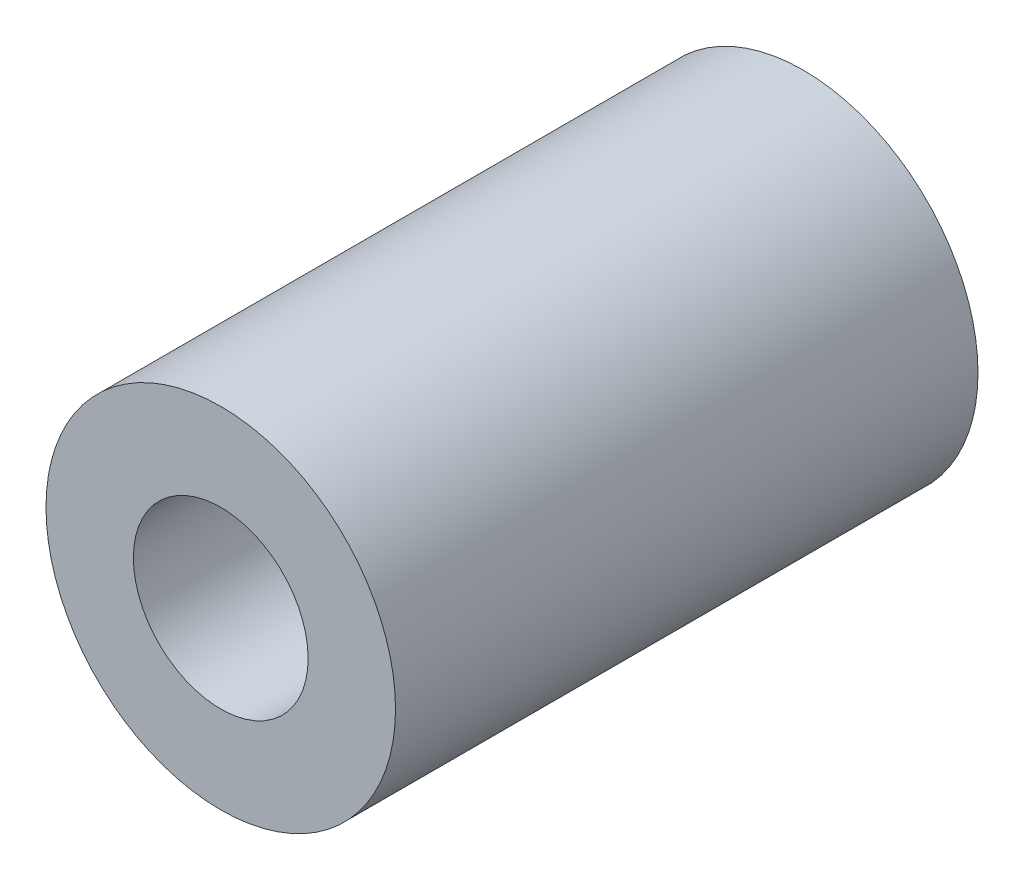
ISO-10303-21;
HEADER;
FILE_DESCRIPTION(('STEP AP214'),'2;1');
FILE_NAME('part.step','',(''),(''),'','','');
FILE_SCHEMA(('AUTOMOTIVE_DESIGN { 1 0 10303 214 1 1 1 1 }'));
ENDSEC;
DATA;
#1=APPLICATION_CONTEXT('core data for automotive mechanical design processes');
#2=APPLICATION_PROTOCOL_DEFINITION('international standard','automotive_design',2000,#1);
#3=PRODUCT_CONTEXT('',#1,'mechanical');
#4=PRODUCT('Part','Part','',(#3));
#5=PRODUCT_RELATED_PRODUCT_CATEGORY('part','',(#4));
#6=PRODUCT_DEFINITION_FORMATION('','',#4);
#7=PRODUCT_DEFINITION_CONTEXT('part definition',#1,'design');
#8=PRODUCT_DEFINITION('design','',#6,#7);
#9=PRODUCT_DEFINITION_SHAPE('','',#8);
#10=(LENGTH_UNIT() NAMED_UNIT(*) SI_UNIT(.MILLI.,.METRE.));
#11=(NAMED_UNIT(*) PLANE_ANGLE_UNIT() SI_UNIT($,.RADIAN.));
#12=(NAMED_UNIT(*) SI_UNIT($,.STERADIAN.) SOLID_ANGLE_UNIT());
#13=UNCERTAINTY_MEASURE_WITH_UNIT(LENGTH_MEASURE(1.E-05),#10,'distance_accuracy_value','');
#14=(GEOMETRIC_REPRESENTATION_CONTEXT(3) GLOBAL_UNCERTAINTY_ASSIGNED_CONTEXT((#13)) GLOBAL_UNIT_ASSIGNED_CONTEXT((#10,
#11,#12)) REPRESENTATION_CONTEXT('',''));
#15=CARTESIAN_POINT('',(0.,0.,0.));
#16=DIRECTION('',(0.,0.,1.));
#17=DIRECTION('',(1.,0.,0.));
#18=AXIS2_PLACEMENT_3D('',#15,#16,#17);
#19=CARTESIAN_POINT('',(0.,0.,-10.));
#20=DIRECTION('',(0.,0.,-1.));
#21=DIRECTION('',(1.,0.,0.));
#22=AXIS2_PLACEMENT_3D('',#19,#20,#21);
#23=PLANE('',#22);
#24=CARTESIAN_POINT('',(0.,0.,-10.));
#25=DIRECTION('',(0.,0.,1.));
#26=DIRECTION('',(1.,0.,0.));
#27=AXIS2_PLACEMENT_3D('',#24,#25,#26);
#28=CIRCLE('',#27,3.);
#29=CARTESIAN_POINT('',(3.,0.,-10.));
#30=VERTEX_POINT('',#29);
#31=EDGE_CURVE('E10',#30,#30,#28,.T.);
#32=ORIENTED_EDGE('',*,*,#31,.F.);
#33=EDGE_LOOP('',(#32));
#34=FACE_BOUND('',#33,.T.);
#35=CARTESIAN_POINT('',(0.,0.,-10.));
#36=DIRECTION('',(0.,0.,1.));
#37=DIRECTION('',(1.,0.,0.));
#38=AXIS2_PLACEMENT_3D('',#35,#36,#37);
#39=CIRCLE('',#38,1.5);
#40=CARTESIAN_POINT('',(1.5,0.,-10.));
#41=VERTEX_POINT('',#40);
#42=EDGE_CURVE('E46',#41,#41,#39,.T.);
#43=ORIENTED_EDGE('',*,*,#42,.T.);
#44=EDGE_LOOP('',(#43));
#45=FACE_BOUND('',#44,.T.);
#46=ADVANCED_FACE('F35',(#34,#45),#23,.T.);
#47=CARTESIAN_POINT('',(0.,0.,0.));
#48=DIRECTION('',(0.,0.,-1.));
#49=DIRECTION('',(1.,0.,0.));
#50=AXIS2_PLACEMENT_3D('',#47,#48,#49);
#51=PLANE('',#50);
#52=CARTESIAN_POINT('',(0.,0.,0.));
#53=DIRECTION('',(0.,0.,1.));
#54=DIRECTION('',(1.,0.,0.));
#55=AXIS2_PLACEMENT_3D('',#52,#53,#54);
#56=CIRCLE('',#55,3.);
#57=CARTESIAN_POINT('',(3.,0.,0.));
#58=VERTEX_POINT('',#57);
#59=EDGE_CURVE('E39',#58,#58,#56,.T.);
#60=ORIENTED_EDGE('',*,*,#59,.T.);
#61=EDGE_LOOP('',(#60));
#62=FACE_BOUND('',#61,.T.);
#63=CARTESIAN_POINT('',(0.,0.,0.));
#64=DIRECTION('',(0.,0.,1.));
#65=DIRECTION('',(1.,0.,0.));
#66=AXIS2_PLACEMENT_3D('',#63,#64,#65);
#67=CIRCLE('',#66,1.5);
#68=CARTESIAN_POINT('',(1.5,0.,0.));
#69=VERTEX_POINT('',#68);
#70=EDGE_CURVE('E48',#69,#69,#67,.T.);
#71=ORIENTED_EDGE('',*,*,#70,.F.);
#72=EDGE_LOOP('',(#71));
#73=FACE_BOUND('',#72,.T.);
#74=ADVANCED_FACE('F61',(#62,#73),#51,.F.);
#75=CARTESIAN_POINT('',(0.,0.,-10.));
#76=DIRECTION('',(0.,0.,1.));
#77=DIRECTION('',(-1.,0.,0.));
#78=AXIS2_PLACEMENT_3D('',#75,#76,#77);
#79=CYLINDRICAL_SURFACE('',#78,3.);
#80=ORIENTED_EDGE('',*,*,#31,.T.);
#81=EDGE_LOOP('',(#80));
#82=FACE_BOUND('',#81,.T.);
#83=ORIENTED_EDGE('',*,*,#59,.F.);
#84=EDGE_LOOP('',(#83));
#85=FACE_BOUND('',#84,.T.);
#86=ADVANCED_FACE('F37',(#82,#85),#79,.T.);
#87=CARTESIAN_POINT('',(0.,0.,-10.));
#88=DIRECTION('',(0.,0.,1.));
#89=DIRECTION('',(-1.,0.,0.));
#90=AXIS2_PLACEMENT_3D('',#87,#88,#89);
#91=CYLINDRICAL_SURFACE('',#90,1.5);
#92=ORIENTED_EDGE('',*,*,#42,.F.);
#93=EDGE_LOOP('',(#92));
#94=FACE_BOUND('',#93,.T.);
#95=ORIENTED_EDGE('',*,*,#70,.T.);
#96=EDGE_LOOP('',(#95));
#97=FACE_BOUND('',#96,.T.);
#98=ADVANCED_FACE('F55',(#94,#97),#91,.F.);
#99=CLOSED_SHELL('',(#46,#74,#86,#98));
#100=MANIFOLD_SOLID_BREP('B2',#99);
#101=ADVANCED_BREP_SHAPE_REPRESENTATION('',(#18,#100),#14);
#102=SHAPE_DEFINITION_REPRESENTATION(#9,#101);
ENDSEC;
END-ISO-10303-21;
